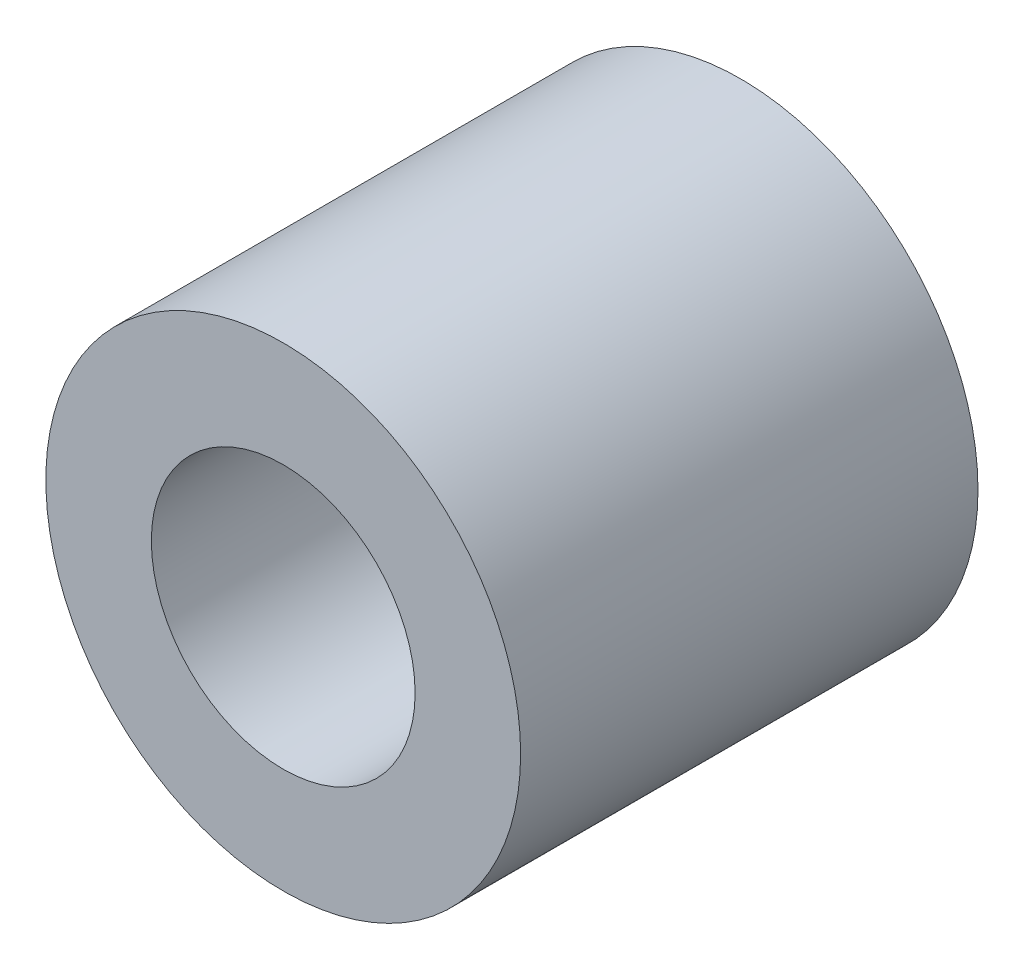
ISO-10303-21;
HEADER;
FILE_DESCRIPTION(('STEP AP214'),'2;1');
FILE_NAME('part.step','',(''),(''),'','','');
FILE_SCHEMA(('AUTOMOTIVE_DESIGN { 1 0 10303 214 1 1 1 1 }'));
ENDSEC;
DATA;
#1=APPLICATION_CONTEXT('core data for automotive mechanical design processes');
#2=APPLICATION_PROTOCOL_DEFINITION('international standard','automotive_design',2000,#1);
#3=PRODUCT_CONTEXT('',#1,'mechanical');
#4=PRODUCT('Part','Part','',(#3));
#5=PRODUCT_RELATED_PRODUCT_CATEGORY('part','',(#4));
#6=PRODUCT_DEFINITION_FORMATION('','',#4);
#7=PRODUCT_DEFINITION_CONTEXT('part definition',#1,'design');
#8=PRODUCT_DEFINITION('design','',#6,#7);
#9=PRODUCT_DEFINITION_SHAPE('','',#8);
#10=(LENGTH_UNIT() NAMED_UNIT(*) SI_UNIT(.MILLI.,.METRE.));
#11=(NAMED_UNIT(*) PLANE_ANGLE_UNIT() SI_UNIT($,.RADIAN.));
#12=(NAMED_UNIT(*) SI_UNIT($,.STERADIAN.) SOLID_ANGLE_UNIT());
#13=UNCERTAINTY_MEASURE_WITH_UNIT(LENGTH_MEASURE(1.E-05),#10,'distance_accuracy_value','');
#14=(GEOMETRIC_REPRESENTATION_CONTEXT(3) GLOBAL_UNCERTAINTY_ASSIGNED_CONTEXT((#13)) GLOBAL_UNIT_ASSIGNED_CONTEXT((#10,
#11,#12)) REPRESENTATION_CONTEXT('',''));
#15=CARTESIAN_POINT('',(0.,0.,0.));
#16=DIRECTION('',(0.,0.,1.));
#17=DIRECTION('',(1.,0.,0.));
#18=AXIS2_PLACEMENT_3D('',#15,#16,#17);
#19=CARTESIAN_POINT('',(0.,0.,8.67));
#20=DIRECTION('',(0.,0.,1.));
#21=DIRECTION('',(1.,0.,0.));
#22=AXIS2_PLACEMENT_3D('',#19,#20,#21);
#23=PLANE('',#22);
#24=CARTESIAN_POINT('',(0.,0.,8.67));
#25=DIRECTION('',(0.,0.,1.));
#26=DIRECTION('',(1.,0.,0.));
#27=AXIS2_PLACEMENT_3D('',#24,#25,#26);
#28=CIRCLE('',#27,4.5);
#29=CARTESIAN_POINT('',(4.5,0.,8.67));
#30=VERTEX_POINT('',#29);
#31=EDGE_CURVE('E10',#30,#30,#28,.T.);
#32=ORIENTED_EDGE('',*,*,#31,.T.);
#33=EDGE_LOOP('',(#32));
#34=FACE_BOUND('',#33,.T.);
#35=CARTESIAN_POINT('',(0.,0.,8.67));
#36=DIRECTION('',(0.,0.,1.));
#37=DIRECTION('',(1.,0.,0.));
#38=AXIS2_PLACEMENT_3D('',#35,#36,#37);
#39=CIRCLE('',#38,2.5);
#40=CARTESIAN_POINT('',(2.5,0.,8.67));
#41=VERTEX_POINT('',#40);
#42=EDGE_CURVE('E42',#41,#41,#39,.T.);
#43=ORIENTED_EDGE('',*,*,#42,.F.);
#44=EDGE_LOOP('',(#43));
#45=FACE_BOUND('',#44,.T.);
#46=ADVANCED_FACE('F31',(#34,#45),#23,.T.);
#47=CARTESIAN_POINT('',(0.,0.,0.));
#48=DIRECTION('',(0.,0.,1.));
#49=DIRECTION('',(1.,0.,0.));
#50=AXIS2_PLACEMENT_3D('',#47,#48,#49);
#51=PLANE('',#50);
#52=CARTESIAN_POINT('',(0.,0.,0.));
#53=DIRECTION('',(0.,0.,1.));
#54=DIRECTION('',(1.,0.,0.));
#55=AXIS2_PLACEMENT_3D('',#52,#53,#54);
#56=CIRCLE('',#55,4.5);
#57=CARTESIAN_POINT('',(4.5,0.,0.));
#58=VERTEX_POINT('',#57);
#59=EDGE_CURVE('E35',#58,#58,#56,.T.);
#60=ORIENTED_EDGE('',*,*,#59,.F.);
#61=EDGE_LOOP('',(#60));
#62=FACE_BOUND('',#61,.T.);
#63=CARTESIAN_POINT('',(0.,0.,0.));
#64=DIRECTION('',(0.,0.,1.));
#65=DIRECTION('',(1.,0.,0.));
#66=AXIS2_PLACEMENT_3D('',#63,#64,#65);
#67=CIRCLE('',#66,2.5);
#68=CARTESIAN_POINT('',(2.5,0.,0.));
#69=VERTEX_POINT('',#68);
#70=EDGE_CURVE('E44',#69,#69,#67,.T.);
#71=ORIENTED_EDGE('',*,*,#70,.T.);
#72=EDGE_LOOP('',(#71));
#73=FACE_BOUND('',#72,.T.);
#74=ADVANCED_FACE('F54',(#62,#73),#51,.F.);
#75=CARTESIAN_POINT('',(0.,0.,8.67));
#76=DIRECTION('',(0.,0.,-1.));
#77=DIRECTION('',(-1.,0.,0.));
#78=AXIS2_PLACEMENT_3D('',#75,#76,#77);
#79=CYLINDRICAL_SURFACE('',#78,4.5);
#80=ORIENTED_EDGE('',*,*,#31,.F.);
#81=EDGE_LOOP('',(#80));
#82=FACE_BOUND('',#81,.T.);
#83=ORIENTED_EDGE('',*,*,#59,.T.);
#84=EDGE_LOOP('',(#83));
#85=FACE_BOUND('',#84,.T.);
#86=ADVANCED_FACE('F33',(#82,#85),#79,.T.);
#87=CARTESIAN_POINT('',(0.,0.,8.67));
#88=DIRECTION('',(0.,0.,-1.));
#89=DIRECTION('',(-1.,0.,0.));
#90=AXIS2_PLACEMENT_3D('',#87,#88,#89);
#91=CYLINDRICAL_SURFACE('',#90,2.5);
#92=ORIENTED_EDGE('',*,*,#42,.T.);
#93=EDGE_LOOP('',(#92));
#94=FACE_BOUND('',#93,.T.);
#95=ORIENTED_EDGE('',*,*,#70,.F.);
#96=EDGE_LOOP('',(#95));
#97=FACE_BOUND('',#96,.T.);
#98=ADVANCED_FACE('F50',(#94,#97),#91,.F.);
#99=CLOSED_SHELL('',(#46,#74,#86,#98));
#100=MANIFOLD_SOLID_BREP('B2',#99);
#101=ADVANCED_BREP_SHAPE_REPRESENTATION('',(#18,#100),#14);
#102=SHAPE_DEFINITION_REPRESENTATION(#9,#101);
ENDSEC;
END-ISO-10303-21;
